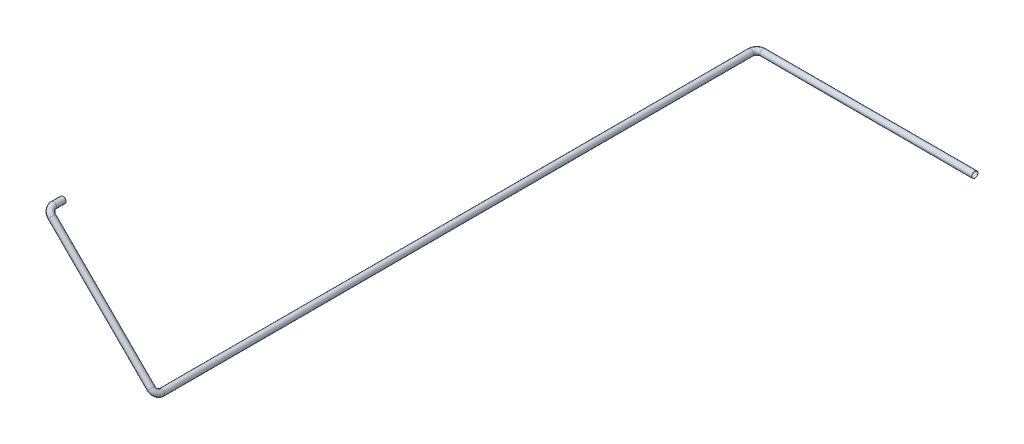
ISO-10303-21;
HEADER;
FILE_DESCRIPTION(('STEP AP214'),'2;1');
FILE_NAME('part.step','',(''),(''),'','','');
FILE_SCHEMA(('AUTOMOTIVE_DESIGN { 1 0 10303 214 1 1 1 1 }'));
ENDSEC;
DATA;
#1=APPLICATION_CONTEXT('core data for automotive mechanical design processes');
#2=APPLICATION_PROTOCOL_DEFINITION('international standard','automotive_design',2000,#1);
#3=PRODUCT_CONTEXT('',#1,'mechanical');
#4=PRODUCT('Part','Part','',(#3));
#5=PRODUCT_RELATED_PRODUCT_CATEGORY('part','',(#4));
#6=PRODUCT_DEFINITION_FORMATION('','',#4);
#7=PRODUCT_DEFINITION_CONTEXT('part definition',#1,'design');
#8=PRODUCT_DEFINITION('design','',#6,#7);
#9=PRODUCT_DEFINITION_SHAPE('','',#8);
#10=(LENGTH_UNIT() NAMED_UNIT(*) SI_UNIT(.MILLI.,.METRE.));
#11=(NAMED_UNIT(*) PLANE_ANGLE_UNIT() SI_UNIT($,.RADIAN.));
#12=(NAMED_UNIT(*) SI_UNIT($,.STERADIAN.) SOLID_ANGLE_UNIT());
#13=UNCERTAINTY_MEASURE_WITH_UNIT(LENGTH_MEASURE(1.E-05),#10,'distance_accuracy_value','');
#14=(GEOMETRIC_REPRESENTATION_CONTEXT(3) GLOBAL_UNCERTAINTY_ASSIGNED_CONTEXT((#13)) GLOBAL_UNIT_ASSIGNED_CONTEXT((#10,
#11,#12)) REPRESENTATION_CONTEXT('',''));
#15=CARTESIAN_POINT('',(0.,0.,0.));
#16=DIRECTION('',(0.,0.,1.));
#17=DIRECTION('',(1.,0.,0.));
#18=AXIS2_PLACEMENT_3D('',#15,#16,#17);
#19=CARTESIAN_POINT('',(-38227.5389894421,-15786.3276394193,44714.7001960568));
#20=DIRECTION('',(0.,0.,-1.));
#21=DIRECTION('',(0.,1.,0.));
#22=AXIS2_PLACEMENT_3D('',#19,#20,#21);
#23=PLANE('',#22);
#24=CARTESIAN_POINT('',(-38227.5389894421,-15786.3276394193,44714.7001960568));
#25=DIRECTION('',(0.,0.,-1.));
#26=DIRECTION('',(0.,1.,0.));
#27=AXIS2_PLACEMENT_3D('',#24,#25,#26);
#28=CIRCLE('',#27,29.0000000000011);
#29=CARTESIAN_POINT('',(-38227.5389894421,-15757.3276394193,44714.7001960568));
#30=VERTEX_POINT('',#29);
#31=EDGE_CURVE('E82',#30,#30,#28,.T.);
#32=ORIENTED_EDGE('',*,*,#31,.F.);
#33=EDGE_LOOP('',(#32));
#34=FACE_BOUND('',#33,.T.);
#35=CARTESIAN_POINT('',(-38227.5389894421,-15786.3276394193,44714.7001960568));
#36=DIRECTION('',(0.,0.,-1.));
#37=DIRECTION('',(0.,1.,0.));
#38=AXIS2_PLACEMENT_3D('',#35,#36,#37);
#39=CIRCLE('',#38,30.0000000000011);
#40=CARTESIAN_POINT('',(-38227.5389894421,-15756.3276394193,44714.7001960568));
#41=VERTEX_POINT('',#40);
#42=EDGE_CURVE('E75',#41,#41,#39,.T.);
#43=ORIENTED_EDGE('',*,*,#42,.T.);
#44=EDGE_LOOP('',(#43));
#45=FACE_BOUND('',#44,.T.);
#46=ADVANCED_FACE('F47',(#34,#45),#23,.T.);
#47=CARTESIAN_POINT('',(-35073.5186954801,-16831.0208281175,39051.7001960568));
#48=DIRECTION('',(-1.,0.,0.));
#49=DIRECTION('',(0.,0.,1.));
#50=AXIS2_PLACEMENT_3D('',#47,#48,#49);
#51=PLANE('',#50);
#52=CARTESIAN_POINT('',(-35073.5186954801,-16831.0208281175,39051.7001960568));
#53=DIRECTION('',(-1.,0.,0.));
#54=DIRECTION('',(0.,0.,1.));
#55=AXIS2_PLACEMENT_3D('',#52,#53,#54);
#56=CIRCLE('',#55,29.0000000000011);
#57=CARTESIAN_POINT('',(-35073.5186954801,-16831.0208281175,39080.7001960568));
#58=VERTEX_POINT('',#57);
#59=EDGE_CURVE('E78',#58,#58,#56,.T.);
#60=ORIENTED_EDGE('',*,*,#59,.T.);
#61=EDGE_LOOP('',(#60));
#62=FACE_BOUND('',#61,.T.);
#63=CARTESIAN_POINT('',(-35073.5186954801,-16831.0208281175,39051.7001960568));
#64=DIRECTION('',(-1.,0.,0.));
#65=DIRECTION('',(0.,0.,1.));
#66=AXIS2_PLACEMENT_3D('',#63,#64,#65);
#67=CIRCLE('',#66,30.0000000000011);
#68=CARTESIAN_POINT('',(-35073.5186954801,-16831.0208281175,39081.7001960568));
#69=VERTEX_POINT('',#68);
#70=EDGE_CURVE('E11',#69,#69,#67,.T.);
#71=ORIENTED_EDGE('',*,*,#70,.F.);
#72=EDGE_LOOP('',(#71));
#73=FACE_BOUND('',#72,.T.);
#74=ADVANCED_FACE('F114',(#62,#73),#51,.F.);
#75=CARTESIAN_POINT('',(-38227.5389894421,-15786.3276394193,44714.7001960568));
#76=DIRECTION('',(0.,0.,1.));
#77=DIRECTION('',(1.,0.,0.));
#78=AXIS2_PLACEMENT_3D('',#75,#76,#77);
#79=CYLINDRICAL_SURFACE('',#78,30.0000000000011);
#80=CARTESIAN_POINT('',(-38227.5389894421,-15786.3276394193,44805.8797089954));
#81=DIRECTION('',(0.,0.,-1.));
#82=DIRECTION('',(0.,1.,0.));
#83=AXIS2_PLACEMENT_3D('',#80,#81,#82);
#84=CIRCLE('',#83,30.0000000000011);
#85=CARTESIAN_POINT('',(-38248.7521928777,-15765.1144359837,44805.8797089954));
#86=VERTEX_POINT('',#85);
#87=EDGE_CURVE('E72',#86,#86,#84,.T.);
#88=ORIENTED_EDGE('',*,*,#87,.T.);
#89=EDGE_LOOP('',(#88));
#90=FACE_BOUND('',#89,.T.);
#91=ORIENTED_EDGE('',*,*,#42,.F.);
#92=EDGE_LOOP('',(#91));
#93=FACE_BOUND('',#92,.T.);
#94=ADVANCED_FACE('F118',(#90,#93),#79,.T.);
#95=CARTESIAN_POINT('',(-38185.1125825709,-15828.7540462905,44805.8797089954));
#96=DIRECTION('',(0.707106781186547,0.707106781186547,0.));
#97=DIRECTION('',(-0.707106781186548,0.707106781186548,0.));
#98=AXIS2_PLACEMENT_3D('',#95,#96,#97);
#99=TOROIDAL_SURFACE('',#98,59.9999999999984,30.0000000000011);
#100=CARTESIAN_POINT('',(-38185.1125825709,-15828.7540462905,44865.8797089954));
#101=DIRECTION('',(-0.707106781186549,0.707106781186546,0.));
#102=DIRECTION('',(0.499999999999987,0.500000000000013,0.707106781186548));
#103=AXIS2_PLACEMENT_3D('',#100,#101,#102);
#104=CIRCLE('',#103,30.0000000000011);
#105=CARTESIAN_POINT('',(-38185.1125825709,-15828.7540462905,44895.8797089954));
#106=VERTEX_POINT('',#105);
#107=EDGE_CURVE('E69',#106,#106,#104,.T.);
#108=CARTESIAN_POINT('',(-38185.1125825709,-15828.7540462905,44805.8797089954));
#109=DIRECTION('',(0.707106781186547,0.707106781186547,0.));
#110=DIRECTION('',(-0.707106781186548,0.707106781186548,0.));
#111=AXIS2_PLACEMENT_3D('',#108,#109,#110);
#112=CIRCLE('',#111,89.9999999999995);
#113=EDGE_CURVE('',#86,#106,#112,.T.);
#114=ORIENTED_EDGE('',*,*,#87,.F.);
#115=ORIENTED_EDGE('',*,*,#107,.T.);
#116=ORIENTED_EDGE('',*,*,#113,.T.);
#117=ORIENTED_EDGE('',*,*,#113,.F.);
#118=EDGE_LOOP('',(#114,#116,#115,#117));
#119=FACE_BOUND('',#118,.T.);
#120=ADVANCED_FACE('F120',(#119),#99,.T.);
#121=CARTESIAN_POINT('',(-38185.1125825709,-15828.7540462905,44865.8797089954));
#122=DIRECTION('',(0.707106781186548,-0.707106781186547,0.));
#123=DIRECTION('',(0.707106781186547,0.707106781186548,0.));
#124=AXIS2_PLACEMENT_3D('',#121,#122,#123);
#125=CYLINDRICAL_SURFACE('',#124,30.0000000000011);
#126=CARTESIAN_POINT('',(-37225.2722076151,-16788.5944212463,44865.8797089954));
#127=DIRECTION('',(-0.70710678118655,0.707106781186545,0.));
#128=DIRECTION('',(0.499999999999997,0.500000000000003,0.707106781186548));
#129=AXIS2_PLACEMENT_3D('',#126,#127,#128);
#130=CIRCLE('',#129,30.0000000000011);
#131=CARTESIAN_POINT('',(-37225.2722076151,-16788.5944212463,44895.8797089954));
#132=VERTEX_POINT('',#131);
#133=EDGE_CURVE('E66',#132,#132,#130,.T.);
#134=ORIENTED_EDGE('',*,*,#133,.T.);
#135=EDGE_LOOP('',(#134));
#136=FACE_BOUND('',#135,.T.);
#137=ORIENTED_EDGE('',*,*,#107,.F.);
#138=EDGE_LOOP('',(#137));
#139=FACE_BOUND('',#138,.T.);
#140=ADVANCED_FACE('F127',(#136,#139),#125,.T.);
#141=CARTESIAN_POINT('',(-37225.2722076151,-16788.5944212463,44805.8797089954));
#142=DIRECTION('',(0.707106781186547,0.707106781186547,0.));
#143=DIRECTION('',(-0.707106781186548,0.707106781186548,0.));
#144=AXIS2_PLACEMENT_3D('',#141,#142,#143);
#145=TOROIDAL_SURFACE('',#144,60.0000000000023,30.0000000000011);
#146=CARTESIAN_POINT('',(-37182.8458007439,-16831.0208281175,44805.8797089954));
#147=DIRECTION('',(0.,0.,1.));
#148=DIRECTION('',(1.,0.,0.));
#149=AXIS2_PLACEMENT_3D('',#146,#147,#148);
#150=CIRCLE('',#149,30.0000000000011);
#151=CARTESIAN_POINT('',(-37161.6325973083,-16852.2340315531,44805.8797089954));
#152=VERTEX_POINT('',#151);
#153=EDGE_CURVE('E61',#152,#152,#150,.T.);
#154=CARTESIAN_POINT('',(-37225.2722076151,-16788.5944212463,44805.8797089954));
#155=DIRECTION('',(0.707106781186547,0.707106781186547,0.));
#156=DIRECTION('',(-0.707106781186548,0.707106781186548,0.));
#157=AXIS2_PLACEMENT_3D('',#154,#155,#156);
#158=CIRCLE('',#157,90.0000000000034);
#159=EDGE_CURVE('',#132,#152,#158,.T.);
#160=ORIENTED_EDGE('',*,*,#133,.F.);
#161=ORIENTED_EDGE('',*,*,#153,.T.);
#162=ORIENTED_EDGE('',*,*,#159,.T.);
#163=ORIENTED_EDGE('',*,*,#159,.F.);
#164=EDGE_LOOP('',(#160,#162,#161,#163));
#165=FACE_BOUND('',#164,.T.);
#166=ADVANCED_FACE('F144',(#165),#145,.T.);
#167=CARTESIAN_POINT('',(-37182.8458007439,-16831.0208281175,44805.8797089954));
#168=DIRECTION('',(0.,0.,-1.));
#169=DIRECTION('',(0.,1.,0.));
#170=AXIS2_PLACEMENT_3D('',#167,#168,#169);
#171=CYLINDRICAL_SURFACE('',#170,30.0000000000011);
#172=CARTESIAN_POINT('',(-37182.8458007439,-16831.0208281175,39111.7001960568));
#173=DIRECTION('',(0.,0.,1.));
#174=DIRECTION('',(1.,0.,0.));
#175=AXIS2_PLACEMENT_3D('',#172,#173,#174);
#176=CIRCLE('',#175,30.0000000000011);
#177=CARTESIAN_POINT('',(-37212.8458007439,-16831.0208281175,39111.7001960568));
#178=VERTEX_POINT('',#177);
#179=EDGE_CURVE('E57',#178,#178,#176,.T.);
#180=ORIENTED_EDGE('',*,*,#179,.T.);
#181=EDGE_LOOP('',(#180));
#182=FACE_BOUND('',#181,.T.);
#183=ORIENTED_EDGE('',*,*,#153,.F.);
#184=EDGE_LOOP('',(#183));
#185=FACE_BOUND('',#184,.T.);
#186=ADVANCED_FACE('F138',(#182,#185),#171,.T.);
#187=CARTESIAN_POINT('',(-37122.8458007439,-16831.0208281175,39111.7001960568));
#188=DIRECTION('',(0.,-1.,0.));
#189=DIRECTION('',(0.,0.,-1.));
#190=AXIS2_PLACEMENT_3D('',#187,#188,#189);
#191=TOROIDAL_SURFACE('',#190,60.0000000000023,30.0000000000011);
#192=CARTESIAN_POINT('',(-37122.8458007437,-16831.0208281175,39051.700196057));
#193=DIRECTION('',(-1.,0.,0.));
#194=DIRECTION('',(0.,0.,1.));
#195=AXIS2_PLACEMENT_3D('',#192,#193,#194);
#196=CIRCLE('',#195,30.0000000000011);
#197=CARTESIAN_POINT('',(-37122.8458007437,-16831.0208281175,39021.7001960568));
#198=VERTEX_POINT('',#197);
#199=EDGE_CURVE('E53',#198,#198,#196,.T.);
#200=CARTESIAN_POINT('',(-37122.8458007439,-16831.0208281175,39111.7001960568));
#201=DIRECTION('',(0.,-1.,0.));
#202=DIRECTION('',(0.,0.,-1.));
#203=AXIS2_PLACEMENT_3D('',#200,#201,#202);
#204=CIRCLE('',#203,90.0000000000034);
#205=EDGE_CURVE('',#178,#198,#204,.T.);
#206=ORIENTED_EDGE('',*,*,#179,.F.);
#207=ORIENTED_EDGE('',*,*,#199,.T.);
#208=ORIENTED_EDGE('',*,*,#205,.T.);
#209=ORIENTED_EDGE('',*,*,#205,.F.);
#210=EDGE_LOOP('',(#206,#208,#207,#209));
#211=FACE_BOUND('',#210,.T.);
#212=ADVANCED_FACE('F133',(#211),#191,.T.);
#213=CARTESIAN_POINT('',(-37122.8458007439,-16831.0208281175,39051.7001960569));
#214=DIRECTION('',(1.,0.,0.));
#215=DIRECTION('',(0.,0.,-1.));
#216=AXIS2_PLACEMENT_3D('',#213,#214,#215);
#217=CYLINDRICAL_SURFACE('',#216,30.0000000000011);
#218=ORIENTED_EDGE('',*,*,#70,.T.);
#219=EDGE_LOOP('',(#218));
#220=FACE_BOUND('',#219,.T.);
#221=ORIENTED_EDGE('',*,*,#199,.F.);
#222=EDGE_LOOP('',(#221));
#223=FACE_BOUND('',#222,.T.);
#224=ADVANCED_FACE('F108',(#220,#223),#217,.T.);
#225=CARTESIAN_POINT('',(-38227.5389894421,-15786.3276394193,44714.7001960568));
#226=DIRECTION('',(0.,0.,1.));
#227=DIRECTION('',(1.,0.,0.));
#228=AXIS2_PLACEMENT_3D('',#225,#226,#227);
#229=CYLINDRICAL_SURFACE('',#228,29.0000000000011);
#230=CARTESIAN_POINT('',(-38227.5389894421,-15786.3276394193,44805.8797089954));
#231=DIRECTION('',(0.,0.,1.));
#232=DIRECTION('',(1.,0.,0.));
#233=AXIS2_PLACEMENT_3D('',#230,#231,#232);
#234=CIRCLE('',#233,29.0000000000011);
#235=CARTESIAN_POINT('',(-38248.0450860965,-15765.8215427649,44805.8797089954));
#236=VERTEX_POINT('',#235);
#237=EDGE_CURVE('E85',#236,#236,#234,.F.);
#238=ORIENTED_EDGE('',*,*,#237,.F.);
#239=EDGE_LOOP('',(#238));
#240=FACE_BOUND('',#239,.T.);
#241=ORIENTED_EDGE('',*,*,#31,.T.);
#242=EDGE_LOOP('',(#241));
#243=FACE_BOUND('',#242,.T.);
#244=ADVANCED_FACE('F105',(#240,#243),#229,.F.);
#245=CARTESIAN_POINT('',(-38185.1125825709,-15828.7540462905,44805.8797089954));
#246=DIRECTION('',(0.707106781186547,0.707106781186547,0.));
#247=DIRECTION('',(-0.707106781186548,0.707106781186548,0.));
#248=AXIS2_PLACEMENT_3D('',#245,#246,#247);
#249=TOROIDAL_SURFACE('',#248,59.9999999999984,29.0000000000011);
#250=CARTESIAN_POINT('',(-38185.1125825709,-15828.7540462905,44865.8797089954));
#251=DIRECTION('',(-0.707106781186547,0.707106781186547,1.62031329255315E-13));
#252=DIRECTION('',(-0.707106781186548,-0.707106781186548,0.));
#253=AXIS2_PLACEMENT_3D('',#250,#251,#252);
#254=CIRCLE('',#253,29.0000000000011);
#255=CARTESIAN_POINT('',(-38185.1125825709,-15828.7540462905,44894.8797089954));
#256=VERTEX_POINT('',#255);
#257=EDGE_CURVE('E97',#256,#256,#254,.T.);
#258=CARTESIAN_POINT('',(-38185.1125825709,-15828.7540462905,44805.8797089954));
#259=DIRECTION('',(0.707106781186547,0.707106781186547,0.));
#260=DIRECTION('',(-0.707106781186548,0.707106781186548,0.));
#261=AXIS2_PLACEMENT_3D('',#258,#259,#260);
#262=CIRCLE('',#261,88.9999999999995);
#263=EDGE_CURVE('',#236,#256,#262,.T.);
#264=ORIENTED_EDGE('',*,*,#237,.T.);
#265=ORIENTED_EDGE('',*,*,#257,.F.);
#266=ORIENTED_EDGE('',*,*,#263,.T.);
#267=ORIENTED_EDGE('',*,*,#263,.F.);
#268=EDGE_LOOP('',(#264,#266,#265,#267));
#269=FACE_BOUND('',#268,.T.);
#270=ADVANCED_FACE('F103',(#269),#249,.F.);
#271=CARTESIAN_POINT('',(-38185.1125825709,-15828.7540462905,44865.8797089954));
#272=DIRECTION('',(0.707106781186548,-0.707106781186547,0.));
#273=DIRECTION('',(0.707106781186547,0.707106781186548,0.));
#274=AXIS2_PLACEMENT_3D('',#271,#272,#273);
#275=CYLINDRICAL_SURFACE('',#274,29.0000000000011);
#276=CARTESIAN_POINT('',(-37225.2722076151,-16788.5944212463,44865.8797089954));
#277=DIRECTION('',(0.707106781186548,-0.707106781186547,0.));
#278=DIRECTION('',(0.707106781186547,0.707106781186548,0.));
#279=AXIS2_PLACEMENT_3D('',#276,#277,#278);
#280=CIRCLE('',#279,29.0000000000011);
#281=CARTESIAN_POINT('',(-37225.2722076151,-16788.5944212463,44894.8797089954));
#282=VERTEX_POINT('',#281);
#283=EDGE_CURVE('E94',#282,#282,#280,.F.);
#284=ORIENTED_EDGE('',*,*,#283,.F.);
#285=EDGE_LOOP('',(#284));
#286=FACE_BOUND('',#285,.T.);
#287=ORIENTED_EDGE('',*,*,#257,.T.);
#288=EDGE_LOOP('',(#287));
#289=FACE_BOUND('',#288,.T.);
#290=ADVANCED_FACE('F195',(#286,#289),#275,.F.);
#291=CARTESIAN_POINT('',(-37225.2722076151,-16788.5944212463,44805.8797089954));
#292=DIRECTION('',(0.707106781186547,0.707106781186547,0.));
#293=DIRECTION('',(-0.707106781186548,0.707106781186548,0.));
#294=AXIS2_PLACEMENT_3D('',#291,#292,#293);
#295=TOROIDAL_SURFACE('',#294,60.0000000000023,29.0000000000011);
#296=CARTESIAN_POINT('',(-37182.8458007439,-16831.0208281175,44805.8797089954));
#297=DIRECTION('',(0.,0.,1.));
#298=DIRECTION('',(1.,0.,0.));
#299=AXIS2_PLACEMENT_3D('',#296,#297,#298);
#300=CIRCLE('',#299,29.0000000000011);
#301=CARTESIAN_POINT('',(-37162.3397040895,-16851.5269247719,44805.8797089954));
#302=VERTEX_POINT('',#301);
#303=EDGE_CURVE('E91',#302,#302,#300,.T.);
#304=CARTESIAN_POINT('',(-37225.2722076151,-16788.5944212463,44805.8797089954));
#305=DIRECTION('',(0.707106781186547,0.707106781186547,0.));
#306=DIRECTION('',(-0.707106781186548,0.707106781186548,0.));
#307=AXIS2_PLACEMENT_3D('',#304,#305,#306);
#308=CIRCLE('',#307,89.0000000000034);
#309=EDGE_CURVE('',#282,#302,#308,.T.);
#310=ORIENTED_EDGE('',*,*,#283,.T.);
#311=ORIENTED_EDGE('',*,*,#303,.F.);
#312=ORIENTED_EDGE('',*,*,#309,.T.);
#313=ORIENTED_EDGE('',*,*,#309,.F.);
#314=EDGE_LOOP('',(#310,#312,#311,#313));
#315=FACE_BOUND('',#314,.T.);
#316=ADVANCED_FACE('F206',(#315),#295,.F.);
#317=CARTESIAN_POINT('',(-37182.8458007439,-16831.0208281175,44805.8797089954));
#318=DIRECTION('',(0.,0.,-1.));
#319=DIRECTION('',(0.,1.,0.));
#320=AXIS2_PLACEMENT_3D('',#317,#318,#319);
#321=CYLINDRICAL_SURFACE('',#320,29.0000000000011);
#322=CARTESIAN_POINT('',(-37182.8458007439,-16831.0208281175,39111.7001960568));
#323=DIRECTION('',(0.,0.,-1.));
#324=DIRECTION('',(0.,1.,0.));
#325=AXIS2_PLACEMENT_3D('',#322,#323,#324);
#326=CIRCLE('',#325,29.0000000000011);
#327=CARTESIAN_POINT('',(-37211.8458007439,-16831.0208281175,39111.7001960568));
#328=VERTEX_POINT('',#327);
#329=EDGE_CURVE('E88',#328,#328,#326,.F.);
#330=ORIENTED_EDGE('',*,*,#329,.F.);
#331=EDGE_LOOP('',(#330));
#332=FACE_BOUND('',#331,.T.);
#333=ORIENTED_EDGE('',*,*,#303,.T.);
#334=EDGE_LOOP('',(#333));
#335=FACE_BOUND('',#334,.T.);
#336=ADVANCED_FACE('F217',(#332,#335),#321,.F.);
#337=CARTESIAN_POINT('',(-37122.8458007439,-16831.0208281175,39111.7001960568));
#338=DIRECTION('',(0.,-1.,0.));
#339=DIRECTION('',(0.,0.,-1.));
#340=AXIS2_PLACEMENT_3D('',#337,#338,#339);
#341=TOROIDAL_SURFACE('',#340,60.0000000000023,29.0000000000011);
#342=CARTESIAN_POINT('',(-37122.8458007438,-16831.0208281175,39051.7001960568));
#343=DIRECTION('',(-1.,0.,-1.42108547152217E-12));
#344=DIRECTION('',(-1.42108547152217E-12,0.,1.));
#345=AXIS2_PLACEMENT_3D('',#342,#343,#344);
#346=CIRCLE('',#345,29.0000000000011);
#347=CARTESIAN_POINT('',(-37122.8458007437,-16831.0208281175,39022.7001960568));
#348=VERTEX_POINT('',#347);
#349=EDGE_CURVE('E81',#348,#348,#346,.T.);
#350=CARTESIAN_POINT('',(-37122.8458007439,-16831.0208281175,39111.7001960568));
#351=DIRECTION('',(0.,-1.,0.));
#352=DIRECTION('',(0.,0.,-1.));
#353=AXIS2_PLACEMENT_3D('',#350,#351,#352);
#354=CIRCLE('',#353,89.0000000000034);
#355=EDGE_CURVE('',#328,#348,#354,.T.);
#356=ORIENTED_EDGE('',*,*,#329,.T.);
#357=ORIENTED_EDGE('',*,*,#349,.F.);
#358=ORIENTED_EDGE('',*,*,#355,.T.);
#359=ORIENTED_EDGE('',*,*,#355,.F.);
#360=EDGE_LOOP('',(#356,#358,#357,#359));
#361=FACE_BOUND('',#360,.T.);
#362=ADVANCED_FACE('F228',(#361),#341,.F.);
#363=CARTESIAN_POINT('',(-37122.8458007439,-16831.0208281175,39051.7001960569));
#364=DIRECTION('',(1.,0.,0.));
#365=DIRECTION('',(0.,0.,-1.));
#366=AXIS2_PLACEMENT_3D('',#363,#364,#365);
#367=CYLINDRICAL_SURFACE('',#366,29.0000000000011);
#368=ORIENTED_EDGE('',*,*,#59,.F.);
#369=EDGE_LOOP('',(#368));
#370=FACE_BOUND('',#369,.T.);
#371=ORIENTED_EDGE('',*,*,#349,.T.);
#372=EDGE_LOOP('',(#371));
#373=FACE_BOUND('',#372,.T.);
#374=ADVANCED_FACE('F115',(#370,#373),#367,.F.);
#375=CLOSED_SHELL('',(#46,#74,#94,#120,#140,#166,#186,#212,#224,#244,#270,#290,#316,#336,#362,#374));
#376=MANIFOLD_SOLID_BREP('B2',#375);
#377=ADVANCED_BREP_SHAPE_REPRESENTATION('',(#18,#376),#14);
#378=SHAPE_DEFINITION_REPRESENTATION(#9,#377);
ENDSEC;
END-ISO-10303-21;
